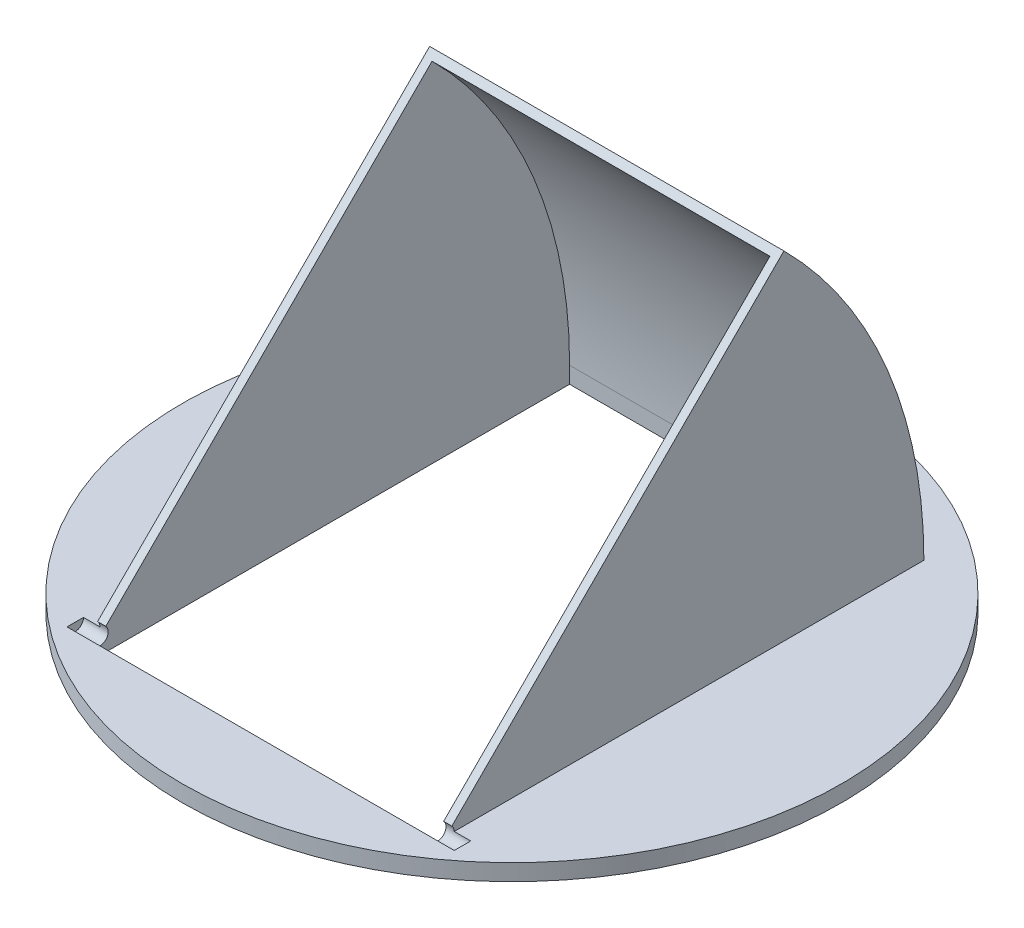
ISO-10303-21;
HEADER;
FILE_DESCRIPTION(('STEP AP214'),'2;1');
FILE_NAME('part.step','',(''),(''),'','','');
FILE_SCHEMA(('AUTOMOTIVE_DESIGN { 1 0 10303 214 1 1 1 1 }'));
ENDSEC;
DATA;
#1=APPLICATION_CONTEXT('core data for automotive mechanical design processes');
#2=APPLICATION_PROTOCOL_DEFINITION('international standard','automotive_design',2000,#1);
#3=PRODUCT_CONTEXT('',#1,'mechanical');
#4=PRODUCT('Part','Part','',(#3));
#5=PRODUCT_RELATED_PRODUCT_CATEGORY('part','',(#4));
#6=PRODUCT_DEFINITION_FORMATION('','',#4);
#7=PRODUCT_DEFINITION_CONTEXT('part definition',#1,'design');
#8=PRODUCT_DEFINITION('design','',#6,#7);
#9=PRODUCT_DEFINITION_SHAPE('','',#8);
#10=(LENGTH_UNIT() NAMED_UNIT(*) SI_UNIT(.MILLI.,.METRE.));
#11=(NAMED_UNIT(*) PLANE_ANGLE_UNIT() SI_UNIT($,.RADIAN.));
#12=(NAMED_UNIT(*) SI_UNIT($,.STERADIAN.) SOLID_ANGLE_UNIT());
#13=UNCERTAINTY_MEASURE_WITH_UNIT(LENGTH_MEASURE(1.E-05),#10,'distance_accuracy_value','');
#14=(GEOMETRIC_REPRESENTATION_CONTEXT(3) GLOBAL_UNCERTAINTY_ASSIGNED_CONTEXT((#13)) GLOBAL_UNIT_ASSIGNED_CONTEXT((#10,
#11,#12)) REPRESENTATION_CONTEXT('',''));
#15=CARTESIAN_POINT('',(0.,0.,0.));
#16=DIRECTION('',(0.,0.,1.));
#17=DIRECTION('',(1.,0.,0.));
#18=AXIS2_PLACEMENT_3D('',#15,#16,#17);
#19=CARTESIAN_POINT('',(0.,6.35,0.));
#20=DIRECTION('',(0.,1.,0.));
#21=DIRECTION('',(0.,0.,1.));
#22=AXIS2_PLACEMENT_3D('',#19,#20,#21);
#23=PLANE('',#22);
#24=CARTESIAN_POINT('',(0.,6.35,0.));
#25=DIRECTION('',(0.,1.,0.));
#26=DIRECTION('',(0.,0.,1.));
#27=AXIS2_PLACEMENT_3D('',#24,#25,#26);
#28=CIRCLE('',#27,127.);
#29=CARTESIAN_POINT('',(0.,6.35,127.));
#30=VERTEX_POINT('',#29);
#31=EDGE_CURVE('E162',#30,#30,#28,.T.);
#32=ORIENTED_EDGE('',*,*,#31,.T.);
#33=EDGE_LOOP('',(#32));
#34=FACE_BOUND('',#33,.T.);
#35=DIRECTION('',(0.,0.,-1.));
#36=VECTOR('',#35,1.);
#37=CARTESIAN_POINT('',(68.2625,6.35,93.6625));
#38=LINE('',#37,#36);
#39=CARTESIAN_POINT('',(68.2625,6.35,90.4875));
#40=VERTEX_POINT('',#39);
#41=CARTESIAN_POINT('',(68.2625,6.35,-90.4875));
#42=VERTEX_POINT('',#41);
#43=EDGE_CURVE('E138',#40,#42,#38,.T.);
#44=ORIENTED_EDGE('',*,*,#43,.F.);
#45=DIRECTION('',(-1.,0.,0.));
#46=VECTOR('',#45,1.);
#47=CARTESIAN_POINT('',(74.6125,6.35,90.4875));
#48=LINE('',#47,#46);
#49=CARTESIAN_POINT('',(74.6125,6.35,90.4875));
#50=VERTEX_POINT('',#49);
#51=EDGE_CURVE('E130',#40,#50,#48,.F.);
#52=ORIENTED_EDGE('',*,*,#51,.T.);
#53=DIRECTION('',(0.,0.,-1.));
#54=VECTOR('',#53,1.);
#55=CARTESIAN_POINT('',(74.6125,6.35,0.));
#56=LINE('',#55,#54);
#57=CARTESIAN_POINT('',(74.6125,6.35,96.8375));
#58=VERTEX_POINT('',#57);
#59=EDGE_CURVE('E11',#58,#50,#56,.T.);
#60=ORIENTED_EDGE('',*,*,#59,.F.);
#61=DIRECTION('',(-1.,0.,0.));
#62=VECTOR('',#61,1.);
#63=CARTESIAN_POINT('',(74.6125,6.35,96.8375));
#64=LINE('',#63,#62);
#65=CARTESIAN_POINT('',(-74.6125,6.35,96.8375));
#66=VERTEX_POINT('',#65);
#67=EDGE_CURVE('E133',#58,#66,#64,.T.);
#68=ORIENTED_EDGE('',*,*,#67,.T.);
#69=DIRECTION('',(0.,0.,-1.));
#70=VECTOR('',#69,1.);
#71=CARTESIAN_POINT('',(-74.6125,6.35,0.));
#72=LINE('',#71,#70);
#73=CARTESIAN_POINT('',(-74.6125,6.35,90.4875));
#74=VERTEX_POINT('',#73);
#75=EDGE_CURVE('E41',#66,#74,#72,.T.);
#76=ORIENTED_EDGE('',*,*,#75,.T.);
#77=CARTESIAN_POINT('',(-68.2625,6.35,90.4875));
#78=VERTEX_POINT('',#77);
#79=EDGE_CURVE('E141',#74,#78,#48,.F.);
#80=ORIENTED_EDGE('',*,*,#79,.T.);
#81=DIRECTION('',(0.,0.,1.));
#82=VECTOR('',#81,1.);
#83=CARTESIAN_POINT('',(-68.2625,6.35,93.6625));
#84=LINE('',#83,#82);
#85=CARTESIAN_POINT('',(-68.2625,6.35,-90.4875));
#86=VERTEX_POINT('',#85);
#87=EDGE_CURVE('E166',#86,#78,#84,.T.);
#88=ORIENTED_EDGE('',*,*,#87,.F.);
#89=DIRECTION('',(1.,0.,0.));
#90=VECTOR('',#89,1.);
#91=CARTESIAN_POINT('',(-68.2625,6.35,-90.4875));
#92=LINE('',#91,#90);
#93=EDGE_CURVE('E202',#86,#42,#92,.T.);
#94=ORIENTED_EDGE('',*,*,#93,.T.);
#95=EDGE_LOOP('',(#44,#52,#60,#68,#76,#80,#88,#94));
#96=FACE_BOUND('',#95,.T.);
#97=ADVANCED_FACE('F33',(#34,#96),#23,.T.);
#98=CARTESIAN_POINT('',(68.2625,187.325,93.6625));
#99=DIRECTION('',(-1.,0.,0.));
#100=DIRECTION('',(0.,0.,1.));
#101=AXIS2_PLACEMENT_3D('',#98,#99,#100);
#102=PLANE('',#101);
#103=CARTESIAN_POINT('',(68.2625,6.35,93.6625));
#104=DIRECTION('',(-1.,0.,0.));
#105=DIRECTION('',(0.,0.,1.));
#106=AXIS2_PLACEMENT_3D('',#103,#104,#105);
#107=CIRCLE('',#106,3.175);
#108=CARTESIAN_POINT('',(68.2625,8.59506403026729,91.4174359697327));
#109=VERTEX_POINT('',#108);
#110=EDGE_CURVE('E139',#40,#109,#107,.F.);
#111=ORIENTED_EDGE('',*,*,#110,.F.);
#112=ORIENTED_EDGE('',*,*,#43,.T.);
#113=CARTESIAN_POINT('',(68.2625,6.35,93.6625));
#114=DIRECTION('',(1.,0.,0.));
#115=DIRECTION('',(0.,0.,-1.));
#116=AXIS2_PLACEMENT_3D('',#113,#114,#115);
#117=CIRCLE('',#116,184.15);
#118=CARTESIAN_POINT('',(68.2625,136.563713755503,-36.5512137555028));
#119=VERTEX_POINT('',#118);
#120=EDGE_CURVE('E205',#42,#119,#117,.T.);
#121=ORIENTED_EDGE('',*,*,#120,.T.);
#122=DIRECTION('',(0.,0.707106781186548,-0.707106781186548));
#123=VECTOR('',#122,1.);
#124=CARTESIAN_POINT('',(68.2625,6.35,93.6625));
#125=LINE('',#124,#123);
#126=EDGE_CURVE('E56',#109,#119,#125,.T.);
#127=ORIENTED_EDGE('',*,*,#126,.F.);
#128=EDGE_LOOP('',(#111,#112,#121,#127));
#129=FACE_BOUND('',#128,.T.);
#130=ADVANCED_FACE('F259',(#129),#102,.F.);
#131=CARTESIAN_POINT('',(-68.2625,187.325,93.6625));
#132=DIRECTION('',(1.,0.,0.));
#133=DIRECTION('',(0.,0.,-1.));
#134=AXIS2_PLACEMENT_3D('',#131,#132,#133);
#135=PLANE('',#134);
#136=CARTESIAN_POINT('',(-68.2625,6.35,93.6625));
#137=DIRECTION('',(1.,0.,0.));
#138=DIRECTION('',(0.,0.,-1.));
#139=AXIS2_PLACEMENT_3D('',#136,#137,#138);
#140=CIRCLE('',#139,3.175);
#141=CARTESIAN_POINT('',(-68.2625,8.59506403026729,91.4174359697327));
#142=VERTEX_POINT('',#141);
#143=EDGE_CURVE('E149',#142,#78,#140,.F.);
#144=ORIENTED_EDGE('',*,*,#143,.F.);
#145=DIRECTION('',(0.,0.707106781186548,-0.707106781186548));
#146=VECTOR('',#145,1.);
#147=CARTESIAN_POINT('',(-68.2625,6.35,93.6625));
#148=LINE('',#147,#146);
#149=CARTESIAN_POINT('',(-68.2625,136.563713755503,-36.5512137555027));
#150=VERTEX_POINT('',#149);
#151=EDGE_CURVE('E219',#142,#150,#148,.T.);
#152=ORIENTED_EDGE('',*,*,#151,.T.);
#153=CARTESIAN_POINT('',(-68.2625,6.35,93.6625));
#154=DIRECTION('',(1.,0.,0.));
#155=DIRECTION('',(0.,0.,-1.));
#156=AXIS2_PLACEMENT_3D('',#153,#154,#155);
#157=CIRCLE('',#156,184.15);
#158=EDGE_CURVE('E204',#86,#150,#157,.T.);
#159=ORIENTED_EDGE('',*,*,#158,.F.);
#160=ORIENTED_EDGE('',*,*,#87,.T.);
#161=EDGE_LOOP('',(#144,#152,#159,#160));
#162=FACE_BOUND('',#161,.T.);
#163=ADVANCED_FACE('F266',(#162),#135,.F.);
#164=CARTESIAN_POINT('',(65.0875,187.325,90.4875));
#165=DIRECTION('',(-1.,0.,0.));
#166=DIRECTION('',(0.,0.,1.));
#167=AXIS2_PLACEMENT_3D('',#164,#165,#166);
#168=PLANE('',#167);
#169=DIRECTION('',(0.,1.,0.));
#170=VECTOR('',#169,1.);
#171=CARTESIAN_POINT('',(65.0875,-0.00100000000000013,93.6625));
#172=LINE('',#171,#170);
#173=CARTESIAN_POINT('',(65.0875,0.,93.6625));
#174=VERTEX_POINT('',#173);
#175=CARTESIAN_POINT('',(65.0875,3.175,93.6625));
#176=VERTEX_POINT('',#175);
#177=EDGE_CURVE('E183',#174,#176,#172,.T.);
#178=ORIENTED_EDGE('',*,*,#177,.T.);
#179=CARTESIAN_POINT('',(65.0875,6.35,93.6625));
#180=DIRECTION('',(-1.,0.,0.));
#181=DIRECTION('',(0.,0.,1.));
#182=AXIS2_PLACEMENT_3D('',#179,#180,#181);
#183=CIRCLE('',#182,3.175);
#184=CARTESIAN_POINT('',(65.0875,8.5950640302673,91.4174359697327));
#185=VERTEX_POINT('',#184);
#186=EDGE_CURVE('E143',#176,#185,#183,.F.);
#187=ORIENTED_EDGE('',*,*,#186,.T.);
#188=DIRECTION('',(0.,-0.707106781186548,0.707106781186548));
#189=VECTOR('',#188,1.);
#190=CARTESIAN_POINT('',(65.0875,98.425,1.58750000000001));
#191=LINE('',#190,#189);
#192=CARTESIAN_POINT('',(65.0875,134.318649725235,-34.3061497252354));
#193=VERTEX_POINT('',#192);
#194=EDGE_CURVE('E208',#193,#185,#191,.T.);
#195=ORIENTED_EDGE('',*,*,#194,.F.);
#196=CARTESIAN_POINT('',(65.0875,6.35,93.6625));
#197=DIRECTION('',(-1.,0.,0.));
#198=DIRECTION('',(0.,0.,1.));
#199=AXIS2_PLACEMENT_3D('',#196,#197,#198);
#200=CIRCLE('',#199,180.975);
#201=CARTESIAN_POINT('',(65.0875,6.35000000000007,-87.3125));
#202=VERTEX_POINT('',#201);
#203=EDGE_CURVE('E174',#193,#202,#200,.T.);
#204=ORIENTED_EDGE('',*,*,#203,.T.);
#205=DIRECTION('',(0.,1.,0.));
#206=VECTOR('',#205,1.);
#207=CARTESIAN_POINT('',(65.0875,-0.00100000000000013,-87.3125));
#208=LINE('',#207,#206);
#209=CARTESIAN_POINT('',(65.0875,0.,-87.3125));
#210=VERTEX_POINT('',#209);
#211=EDGE_CURVE('E187',#210,#202,#208,.T.);
#212=ORIENTED_EDGE('',*,*,#211,.F.);
#213=DIRECTION('',(0.,0.,1.));
#214=VECTOR('',#213,1.);
#215=CARTESIAN_POINT('',(65.0875,0.,93.6625));
#216=LINE('',#215,#214);
#217=EDGE_CURVE('E200',#210,#174,#216,.T.);
#218=ORIENTED_EDGE('',*,*,#217,.T.);
#219=EDGE_LOOP('',(#178,#187,#195,#204,#212,#218));
#220=FACE_BOUND('',#219,.T.);
#221=ADVANCED_FACE('F225',(#220),#168,.T.);
#222=CARTESIAN_POINT('',(-65.0875,187.325,90.4875));
#223=DIRECTION('',(1.,0.,0.));
#224=DIRECTION('',(0.,0.,-1.));
#225=AXIS2_PLACEMENT_3D('',#222,#223,#224);
#226=PLANE('',#225);
#227=DIRECTION('',(0.,0.707106781186548,-0.707106781186548));
#228=VECTOR('',#227,1.);
#229=CARTESIAN_POINT('',(-65.0875,98.425,1.58750000000001));
#230=LINE('',#229,#228);
#231=CARTESIAN_POINT('',(-65.0875,8.59506403026727,91.4174359697327));
#232=VERTEX_POINT('',#231);
#233=CARTESIAN_POINT('',(-65.0875,134.318649725235,-34.3061497252354));
#234=VERTEX_POINT('',#233);
#235=EDGE_CURVE('E213',#232,#234,#230,.T.);
#236=ORIENTED_EDGE('',*,*,#235,.F.);
#237=CARTESIAN_POINT('',(-65.0875,6.35,93.6625));
#238=DIRECTION('',(1.,0.,0.));
#239=DIRECTION('',(0.,0.,-1.));
#240=AXIS2_PLACEMENT_3D('',#237,#238,#239);
#241=CIRCLE('',#240,3.175);
#242=CARTESIAN_POINT('',(-65.0875,3.175,93.6625));
#243=VERTEX_POINT('',#242);
#244=EDGE_CURVE('E48',#232,#243,#241,.F.);
#245=ORIENTED_EDGE('',*,*,#244,.T.);
#246=DIRECTION('',(0.,1.,0.));
#247=VECTOR('',#246,1.);
#248=CARTESIAN_POINT('',(-65.0875,-0.00100000000000013,93.6625));
#249=LINE('',#248,#247);
#250=CARTESIAN_POINT('',(-65.0875,0.,93.6625));
#251=VERTEX_POINT('',#250);
#252=EDGE_CURVE('E180',#251,#243,#249,.T.);
#253=ORIENTED_EDGE('',*,*,#252,.F.);
#254=DIRECTION('',(0.,0.,-1.));
#255=VECTOR('',#254,1.);
#256=CARTESIAN_POINT('',(-65.0875,0.,93.6625));
#257=LINE('',#256,#255);
#258=CARTESIAN_POINT('',(-65.0875,0.,-87.3125));
#259=VERTEX_POINT('',#258);
#260=EDGE_CURVE('E194',#251,#259,#257,.T.);
#261=ORIENTED_EDGE('',*,*,#260,.T.);
#262=DIRECTION('',(0.,1.,0.));
#263=VECTOR('',#262,1.);
#264=CARTESIAN_POINT('',(-65.0875,-0.00100000000000013,-87.3125));
#265=LINE('',#264,#263);
#266=CARTESIAN_POINT('',(-65.0875,6.35,-87.3125));
#267=VERTEX_POINT('',#266);
#268=EDGE_CURVE('E179',#259,#267,#265,.T.);
#269=ORIENTED_EDGE('',*,*,#268,.T.);
#270=CARTESIAN_POINT('',(-65.0875,6.35,93.6625));
#271=DIRECTION('',(1.,0.,0.));
#272=DIRECTION('',(0.,0.,-1.));
#273=AXIS2_PLACEMENT_3D('',#270,#271,#272);
#274=CIRCLE('',#273,180.975);
#275=EDGE_CURVE('E171',#267,#234,#274,.T.);
#276=ORIENTED_EDGE('',*,*,#275,.T.);
#277=EDGE_LOOP('',(#236,#245,#253,#261,#269,#276));
#278=FACE_BOUND('',#277,.T.);
#279=ADVANCED_FACE('F236',(#278),#226,.T.);
#280=CARTESIAN_POINT('',(-65.0875,-0.00100000000000013,93.6625));
#281=DIRECTION('',(0.,0.,1.));
#282=DIRECTION('',(1.,0.,0.));
#283=AXIS2_PLACEMENT_3D('',#280,#281,#282);
#284=PLANE('',#283);
#285=DIRECTION('',(-1.,0.,0.));
#286=VECTOR('',#285,1.);
#287=CARTESIAN_POINT('',(74.6125,3.175,93.6625));
#288=LINE('',#287,#286);
#289=EDGE_CURVE('E148',#176,#243,#288,.T.);
#290=ORIENTED_EDGE('',*,*,#289,.F.);
#291=ORIENTED_EDGE('',*,*,#177,.F.);
#292=DIRECTION('',(-1.,0.,0.));
#293=VECTOR('',#292,1.);
#294=CARTESIAN_POINT('',(-65.0875,0.,93.6625));
#295=LINE('',#294,#293);
#296=EDGE_CURVE('E176',#174,#251,#295,.T.);
#297=ORIENTED_EDGE('',*,*,#296,.T.);
#298=ORIENTED_EDGE('',*,*,#252,.T.);
#299=EDGE_LOOP('',(#290,#291,#297,#298));
#300=FACE_BOUND('',#299,.T.);
#301=ADVANCED_FACE('F245',(#300),#284,.F.);
#302=CARTESIAN_POINT('',(-68.2625,6.35,93.6625));
#303=DIRECTION('',(0.,-0.707106781186547,-0.707106781186547));
#304=DIRECTION('',(0.,0.707106781186548,-0.707106781186548));
#305=AXIS2_PLACEMENT_3D('',#302,#303,#304);
#306=PLANE('',#305);
#307=DIRECTION('',(-1.,0.,0.));
#308=VECTOR('',#307,1.);
#309=CARTESIAN_POINT('',(74.6125,8.59506403026729,91.4174359697327));
#310=LINE('',#309,#308);
#311=EDGE_CURVE('E158',#109,#185,#310,.T.);
#312=ORIENTED_EDGE('',*,*,#311,.F.);
#313=ORIENTED_EDGE('',*,*,#126,.T.);
#314=DIRECTION('',(1.,0.,0.));
#315=VECTOR('',#314,1.);
#316=CARTESIAN_POINT('',(-68.2625,136.563713755503,-36.5512137555027));
#317=LINE('',#316,#315);
#318=EDGE_CURVE('E217',#150,#119,#317,.T.);
#319=ORIENTED_EDGE('',*,*,#318,.F.);
#320=ORIENTED_EDGE('',*,*,#151,.F.);
#321=EDGE_CURVE('E159',#232,#142,#310,.T.);
#322=ORIENTED_EDGE('',*,*,#321,.F.);
#323=ORIENTED_EDGE('',*,*,#235,.T.);
#324=DIRECTION('',(1.,0.,0.));
#325=VECTOR('',#324,1.);
#326=CARTESIAN_POINT('',(-68.2625,134.318649725235,-34.3061497252354));
#327=LINE('',#326,#325);
#328=EDGE_CURVE('E215',#234,#193,#327,.T.);
#329=ORIENTED_EDGE('',*,*,#328,.T.);
#330=ORIENTED_EDGE('',*,*,#194,.T.);
#331=EDGE_LOOP('',(#312,#313,#319,#320,#322,#323,#329,#330));
#332=FACE_BOUND('',#331,.T.);
#333=ADVANCED_FACE('F229',(#332),#306,.F.);
#334=CARTESIAN_POINT('',(0.,6.35,0.));
#335=DIRECTION('',(0.,-1.,0.));
#336=DIRECTION('',(0.,0.,-1.));
#337=AXIS2_PLACEMENT_3D('',#334,#335,#336);
#338=CYLINDRICAL_SURFACE('',#337,127.);
#339=ORIENTED_EDGE('',*,*,#31,.F.);
#340=EDGE_LOOP('',(#339));
#341=FACE_BOUND('',#340,.T.);
#342=CARTESIAN_POINT('',(0.,0.,0.));
#343=DIRECTION('',(0.,1.,0.));
#344=DIRECTION('',(0.,0.,1.));
#345=AXIS2_PLACEMENT_3D('',#342,#343,#344);
#346=CIRCLE('',#345,127.);
#347=CARTESIAN_POINT('',(0.,0.,127.));
#348=VERTEX_POINT('',#347);
#349=EDGE_CURVE('E163',#348,#348,#346,.T.);
#350=ORIENTED_EDGE('',*,*,#349,.T.);
#351=EDGE_LOOP('',(#350));
#352=FACE_BOUND('',#351,.T.);
#353=ADVANCED_FACE('F35',(#341,#352),#338,.T.);
#354=CARTESIAN_POINT('',(0.,0.,0.));
#355=DIRECTION('',(0.,1.,0.));
#356=DIRECTION('',(0.,0.,1.));
#357=AXIS2_PLACEMENT_3D('',#354,#355,#356);
#358=PLANE('',#357);
#359=DIRECTION('',(1.,0.,0.));
#360=VECTOR('',#359,1.);
#361=CARTESIAN_POINT('',(-65.0875,0.,-87.3125));
#362=LINE('',#361,#360);
#363=EDGE_CURVE('E197',#259,#210,#362,.T.);
#364=ORIENTED_EDGE('',*,*,#363,.F.);
#365=ORIENTED_EDGE('',*,*,#260,.F.);
#366=ORIENTED_EDGE('',*,*,#296,.F.);
#367=ORIENTED_EDGE('',*,*,#217,.F.);
#368=EDGE_LOOP('',(#364,#365,#366,#367));
#369=FACE_BOUND('',#368,.T.);
#370=ORIENTED_EDGE('',*,*,#349,.F.);
#371=EDGE_LOOP('',(#370));
#372=FACE_BOUND('',#371,.T.);
#373=ADVANCED_FACE('F246',(#369,#372),#358,.F.);
#374=CARTESIAN_POINT('',(-65.0875,-0.00100000000000013,-87.3125));
#375=DIRECTION('',(0.,0.,-1.));
#376=DIRECTION('',(-1.,0.,0.));
#377=AXIS2_PLACEMENT_3D('',#374,#375,#376);
#378=PLANE('',#377);
#379=ORIENTED_EDGE('',*,*,#363,.T.);
#380=ORIENTED_EDGE('',*,*,#211,.T.);
#381=DIRECTION('',(-1.,0.,0.));
#382=VECTOR('',#381,1.);
#383=CARTESIAN_POINT('',(-65.0875,6.35,-87.3125));
#384=LINE('',#383,#382);
#385=EDGE_CURVE('E184',#202,#267,#384,.T.);
#386=ORIENTED_EDGE('',*,*,#385,.T.);
#387=ORIENTED_EDGE('',*,*,#268,.F.);
#388=EDGE_LOOP('',(#379,#380,#386,#387));
#389=FACE_BOUND('',#388,.T.);
#390=ADVANCED_FACE('F240',(#389),#378,.F.);
#391=CARTESIAN_POINT('',(-68.2625,6.35000000000005,93.6624999999999));
#392=DIRECTION('',(1.,0.,0.));
#393=DIRECTION('',(0.,0.,-1.));
#394=AXIS2_PLACEMENT_3D('',#391,#392,#393);
#395=CYLINDRICAL_SURFACE('',#394,180.975);
#396=ORIENTED_EDGE('',*,*,#328,.F.);
#397=ORIENTED_EDGE('',*,*,#275,.F.);
#398=ORIENTED_EDGE('',*,*,#385,.F.);
#399=ORIENTED_EDGE('',*,*,#203,.F.);
#400=EDGE_LOOP('',(#396,#397,#398,#399));
#401=FACE_BOUND('',#400,.T.);
#402=ADVANCED_FACE('F233',(#401),#395,.F.);
#403=CARTESIAN_POINT('',(-68.2625,6.35,93.6625));
#404=DIRECTION('',(1.,0.,0.));
#405=DIRECTION('',(0.,0.,-1.));
#406=AXIS2_PLACEMENT_3D('',#403,#404,#405);
#407=CYLINDRICAL_SURFACE('',#406,184.15);
#408=ORIENTED_EDGE('',*,*,#318,.T.);
#409=ORIENTED_EDGE('',*,*,#120,.F.);
#410=ORIENTED_EDGE('',*,*,#93,.F.);
#411=ORIENTED_EDGE('',*,*,#158,.T.);
#412=EDGE_LOOP('',(#408,#409,#410,#411));
#413=FACE_BOUND('',#412,.T.);
#414=ADVANCED_FACE('F281',(#413),#407,.T.);
#415=CARTESIAN_POINT('',(74.6125,6.35,93.6625));
#416=DIRECTION('',(-1.,0.,0.));
#417=DIRECTION('',(0.,0.,1.));
#418=AXIS2_PLACEMENT_3D('',#415,#416,#417);
#419=CYLINDRICAL_SURFACE('',#418,3.175);
#420=CARTESIAN_POINT('',(74.6125,6.35,93.6625));
#421=DIRECTION('',(1.,0.,0.));
#422=DIRECTION('',(0.,0.,-1.));
#423=AXIS2_PLACEMENT_3D('',#420,#421,#422);
#424=CIRCLE('',#423,3.175);
#425=EDGE_CURVE('E125',#58,#50,#424,.T.);
#426=ORIENTED_EDGE('',*,*,#425,.T.);
#427=ORIENTED_EDGE('',*,*,#51,.F.);
#428=ORIENTED_EDGE('',*,*,#110,.T.);
#429=ORIENTED_EDGE('',*,*,#311,.T.);
#430=ORIENTED_EDGE('',*,*,#186,.F.);
#431=ORIENTED_EDGE('',*,*,#289,.T.);
#432=ORIENTED_EDGE('',*,*,#244,.F.);
#433=ORIENTED_EDGE('',*,*,#321,.T.);
#434=ORIENTED_EDGE('',*,*,#143,.T.);
#435=ORIENTED_EDGE('',*,*,#79,.F.);
#436=CARTESIAN_POINT('',(-74.6125,6.35,93.6625));
#437=DIRECTION('',(1.,0.,0.));
#438=DIRECTION('',(0.,0.,-1.));
#439=AXIS2_PLACEMENT_3D('',#436,#437,#438);
#440=CIRCLE('',#439,3.175);
#441=EDGE_CURVE('E134',#66,#74,#440,.T.);
#442=ORIENTED_EDGE('',*,*,#441,.F.);
#443=ORIENTED_EDGE('',*,*,#67,.F.);
#444=EDGE_LOOP('',(#426,#427,#428,#429,#430,#431,#432,#433,#434,#435,#442,#443));
#445=FACE_BOUND('',#444,.T.);
#446=ADVANCED_FACE('F129',(#445),#419,.F.);
#447=CARTESIAN_POINT('',(74.6125,6.35,93.6625));
#448=DIRECTION('',(1.,0.,0.));
#449=DIRECTION('',(0.,0.,-1.));
#450=AXIS2_PLACEMENT_3D('',#447,#448,#449);
#451=PLANE('',#450);
#452=ORIENTED_EDGE('',*,*,#59,.T.);
#453=ORIENTED_EDGE('',*,*,#425,.F.);
#454=EDGE_LOOP('',(#452,#453));
#455=FACE_BOUND('',#454,.T.);
#456=ADVANCED_FACE('F124',(#455),#451,.F.);
#457=CARTESIAN_POINT('',(-74.6125,6.35,93.6625));
#458=DIRECTION('',(1.,0.,0.));
#459=DIRECTION('',(0.,0.,-1.));
#460=AXIS2_PLACEMENT_3D('',#457,#458,#459);
#461=PLANE('',#460);
#462=ORIENTED_EDGE('',*,*,#441,.T.);
#463=ORIENTED_EDGE('',*,*,#75,.F.);
#464=EDGE_LOOP('',(#462,#463));
#465=FACE_BOUND('',#464,.T.);
#466=ADVANCED_FACE('F157',(#465),#461,.T.);
#467=CLOSED_SHELL('',(#97,#130,#163,#221,#279,#301,#333,#353,#373,#390,#402,#414,#446,#456,#466));
#468=MANIFOLD_SOLID_BREP('B2',#467);
#469=ADVANCED_BREP_SHAPE_REPRESENTATION('',(#18,#468),#14);
#470=SHAPE_DEFINITION_REPRESENTATION(#9,#469);
ENDSEC;
END-ISO-10303-21;
